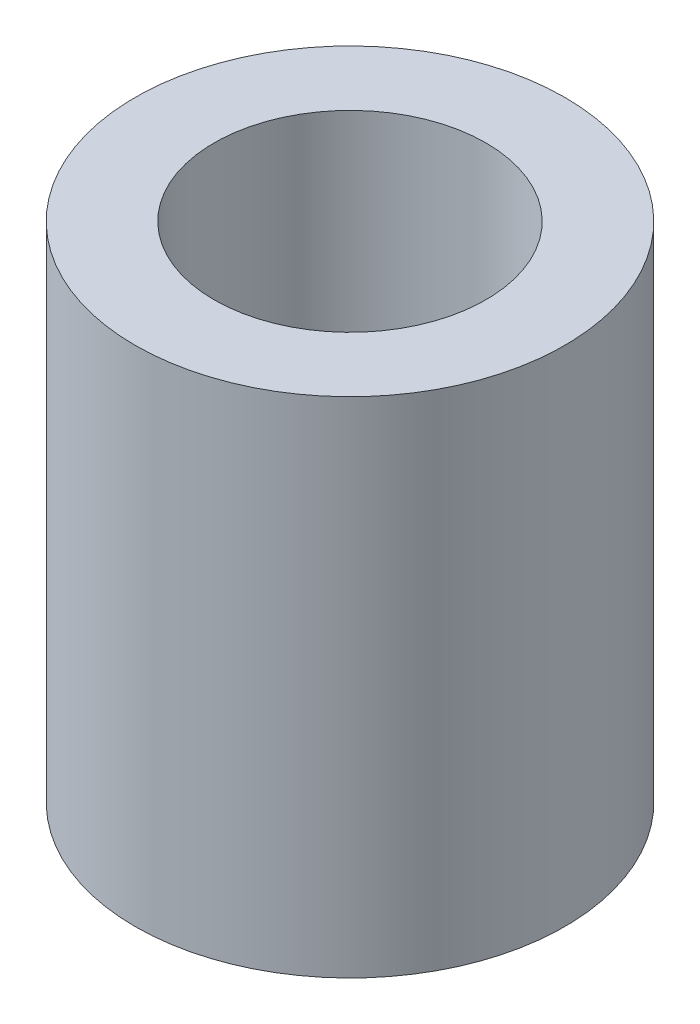
ISO-10303-21;
HEADER;
FILE_DESCRIPTION(('STEP AP214'),'2;1');
FILE_NAME('part.step','',(''),(''),'','','');
FILE_SCHEMA(('AUTOMOTIVE_DESIGN { 1 0 10303 214 1 1 1 1 }'));
ENDSEC;
DATA;
#1=APPLICATION_CONTEXT('core data for automotive mechanical design processes');
#2=APPLICATION_PROTOCOL_DEFINITION('international standard','automotive_design',2000,#1);
#3=PRODUCT_CONTEXT('',#1,'mechanical');
#4=PRODUCT('Part','Part','',(#3));
#5=PRODUCT_RELATED_PRODUCT_CATEGORY('part','',(#4));
#6=PRODUCT_DEFINITION_FORMATION('','',#4);
#7=PRODUCT_DEFINITION_CONTEXT('part definition',#1,'design');
#8=PRODUCT_DEFINITION('design','',#6,#7);
#9=PRODUCT_DEFINITION_SHAPE('','',#8);
#10=(LENGTH_UNIT() NAMED_UNIT(*) SI_UNIT(.MILLI.,.METRE.));
#11=(NAMED_UNIT(*) PLANE_ANGLE_UNIT() SI_UNIT($,.RADIAN.));
#12=(NAMED_UNIT(*) SI_UNIT($,.STERADIAN.) SOLID_ANGLE_UNIT());
#13=UNCERTAINTY_MEASURE_WITH_UNIT(LENGTH_MEASURE(1.E-05),#10,'distance_accuracy_value','');
#14=(GEOMETRIC_REPRESENTATION_CONTEXT(3) GLOBAL_UNCERTAINTY_ASSIGNED_CONTEXT((#13)) GLOBAL_UNIT_ASSIGNED_CONTEXT((#10,
#11,#12)) REPRESENTATION_CONTEXT('',''));
#15=CARTESIAN_POINT('',(0.,0.,0.));
#16=DIRECTION('',(0.,0.,1.));
#17=DIRECTION('',(1.,0.,0.));
#18=AXIS2_PLACEMENT_3D('',#15,#16,#17);
#19=CARTESIAN_POINT('',(0.,7.5,0.));
#20=DIRECTION('',(0.,1.,0.));
#21=DIRECTION('',(0.,0.,1.));
#22=AXIS2_PLACEMENT_3D('',#19,#20,#21);
#23=PLANE('',#22);
#24=CARTESIAN_POINT('',(0.,7.5,0.));
#25=DIRECTION('',(0.,1.,0.));
#26=DIRECTION('',(0.,0.,1.));
#27=AXIS2_PLACEMENT_3D('',#24,#25,#26);
#28=CIRCLE('',#27,3.2);
#29=CARTESIAN_POINT('',(0.,7.5,3.2));
#30=VERTEX_POINT('',#29);
#31=EDGE_CURVE('E10',#30,#30,#28,.T.);
#32=ORIENTED_EDGE('',*,*,#31,.T.);
#33=EDGE_LOOP('',(#32));
#34=FACE_BOUND('',#33,.T.);
#35=CARTESIAN_POINT('',(0.,7.5,0.));
#36=DIRECTION('',(0.,1.,0.));
#37=DIRECTION('',(0.,0.,1.));
#38=AXIS2_PLACEMENT_3D('',#35,#36,#37);
#39=CIRCLE('',#38,2.025);
#40=CARTESIAN_POINT('',(0.,7.5,2.025));
#41=VERTEX_POINT('',#40);
#42=EDGE_CURVE('E45',#41,#41,#39,.T.);
#43=ORIENTED_EDGE('',*,*,#42,.F.);
#44=EDGE_LOOP('',(#43));
#45=FACE_BOUND('',#44,.T.);
#46=ADVANCED_FACE('F34',(#34,#45),#23,.T.);
#47=CARTESIAN_POINT('',(0.,0.,0.));
#48=DIRECTION('',(0.,1.,0.));
#49=DIRECTION('',(0.,0.,1.));
#50=AXIS2_PLACEMENT_3D('',#47,#48,#49);
#51=PLANE('',#50);
#52=CARTESIAN_POINT('',(0.,0.,0.));
#53=DIRECTION('',(0.,1.,0.));
#54=DIRECTION('',(0.,0.,1.));
#55=AXIS2_PLACEMENT_3D('',#52,#53,#54);
#56=CIRCLE('',#55,3.2);
#57=CARTESIAN_POINT('',(0.,0.,3.2));
#58=VERTEX_POINT('',#57);
#59=EDGE_CURVE('E38',#58,#58,#56,.T.);
#60=ORIENTED_EDGE('',*,*,#59,.F.);
#61=EDGE_LOOP('',(#60));
#62=FACE_BOUND('',#61,.T.);
#63=CARTESIAN_POINT('',(0.,0.,0.));
#64=DIRECTION('',(0.,1.,0.));
#65=DIRECTION('',(0.,0.,1.));
#66=AXIS2_PLACEMENT_3D('',#63,#64,#65);
#67=CIRCLE('',#66,2.025);
#68=CARTESIAN_POINT('',(0.,0.,2.025));
#69=VERTEX_POINT('',#68);
#70=EDGE_CURVE('E47',#69,#69,#67,.T.);
#71=ORIENTED_EDGE('',*,*,#70,.T.);
#72=EDGE_LOOP('',(#71));
#73=FACE_BOUND('',#72,.T.);
#74=ADVANCED_FACE('F57',(#62,#73),#51,.F.);
#75=CARTESIAN_POINT('',(0.,7.5,0.));
#76=DIRECTION('',(0.,-1.,0.));
#77=DIRECTION('',(0.,0.,-1.));
#78=AXIS2_PLACEMENT_3D('',#75,#76,#77);
#79=CYLINDRICAL_SURFACE('',#78,3.2);
#80=ORIENTED_EDGE('',*,*,#31,.F.);
#81=EDGE_LOOP('',(#80));
#82=FACE_BOUND('',#81,.T.);
#83=ORIENTED_EDGE('',*,*,#59,.T.);
#84=EDGE_LOOP('',(#83));
#85=FACE_BOUND('',#84,.T.);
#86=ADVANCED_FACE('F36',(#82,#85),#79,.T.);
#87=CARTESIAN_POINT('',(0.,7.5,0.));
#88=DIRECTION('',(0.,-1.,0.));
#89=DIRECTION('',(0.,0.,-1.));
#90=AXIS2_PLACEMENT_3D('',#87,#88,#89);
#91=CYLINDRICAL_SURFACE('',#90,2.025);
#92=ORIENTED_EDGE('',*,*,#42,.T.);
#93=EDGE_LOOP('',(#92));
#94=FACE_BOUND('',#93,.T.);
#95=ORIENTED_EDGE('',*,*,#70,.F.);
#96=EDGE_LOOP('',(#95));
#97=FACE_BOUND('',#96,.T.);
#98=ADVANCED_FACE('F53',(#94,#97),#91,.F.);
#99=CLOSED_SHELL('',(#46,#74,#86,#98));
#100=MANIFOLD_SOLID_BREP('B2',#99);
#101=ADVANCED_BREP_SHAPE_REPRESENTATION('',(#18,#100),#14);
#102=SHAPE_DEFINITION_REPRESENTATION(#9,#101);
ENDSEC;
END-ISO-10303-21;
